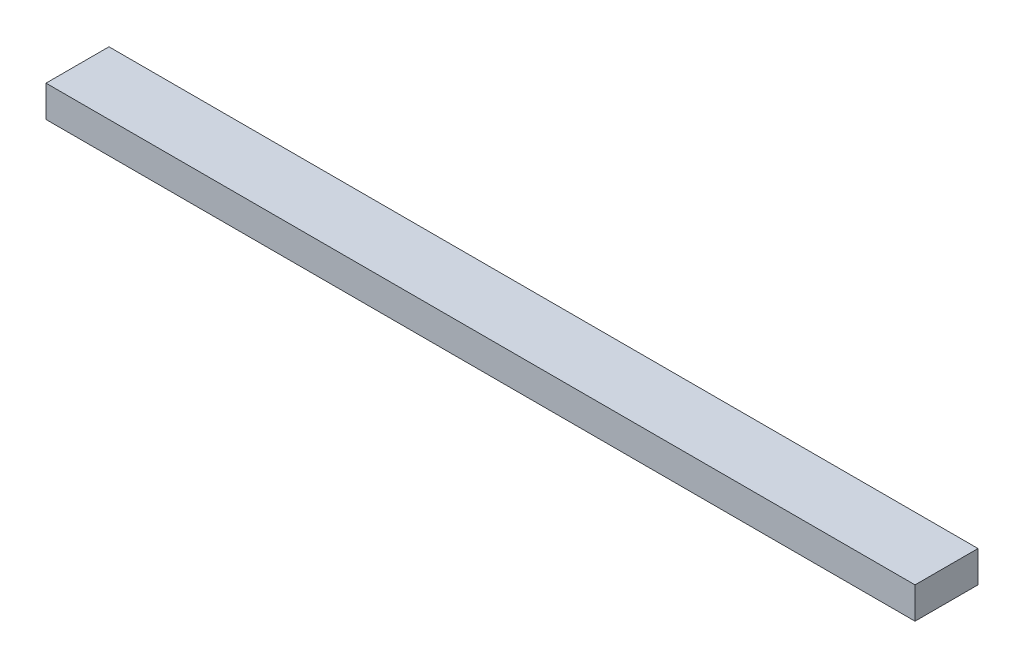
ISO-10303-21;
HEADER;
FILE_DESCRIPTION(('STEP AP214'),'2;1');
FILE_NAME('part.step','',(''),(''),'','','');
FILE_SCHEMA(('AUTOMOTIVE_DESIGN { 1 0 10303 214 1 1 1 1 }'));
ENDSEC;
DATA;
#1=APPLICATION_CONTEXT('core data for automotive mechanical design processes');
#2=APPLICATION_PROTOCOL_DEFINITION('international standard','automotive_design',2000,#1);
#3=PRODUCT_CONTEXT('',#1,'mechanical');
#4=PRODUCT('Part','Part','',(#3));
#5=PRODUCT_RELATED_PRODUCT_CATEGORY('part','',(#4));
#6=PRODUCT_DEFINITION_FORMATION('','',#4);
#7=PRODUCT_DEFINITION_CONTEXT('part definition',#1,'design');
#8=PRODUCT_DEFINITION('design','',#6,#7);
#9=PRODUCT_DEFINITION_SHAPE('','',#8);
#10=(LENGTH_UNIT() NAMED_UNIT(*) SI_UNIT(.MILLI.,.METRE.));
#11=(NAMED_UNIT(*) PLANE_ANGLE_UNIT() SI_UNIT($,.RADIAN.));
#12=(NAMED_UNIT(*) SI_UNIT($,.STERADIAN.) SOLID_ANGLE_UNIT());
#13=UNCERTAINTY_MEASURE_WITH_UNIT(LENGTH_MEASURE(1.E-05),#10,'distance_accuracy_value','');
#14=(GEOMETRIC_REPRESENTATION_CONTEXT(3) GLOBAL_UNCERTAINTY_ASSIGNED_CONTEXT((#13)) GLOBAL_UNIT_ASSIGNED_CONTEXT((#10,
#11,#12)) REPRESENTATION_CONTEXT('',''));
#15=CARTESIAN_POINT('',(0.,0.,0.));
#16=DIRECTION('',(0.,0.,1.));
#17=DIRECTION('',(1.,0.,0.));
#18=AXIS2_PLACEMENT_3D('',#15,#16,#17);
#19=CARTESIAN_POINT('',(87.63,6.35,6.35));
#20=DIRECTION('',(-1.,0.,0.));
#21=DIRECTION('',(0.,0.,1.));
#22=AXIS2_PLACEMENT_3D('',#19,#20,#21);
#23=PLANE('',#22);
#24=DIRECTION('',(0.,0.,-1.));
#25=VECTOR('',#24,1.);
#26=CARTESIAN_POINT('',(87.63,0.,6.35));
#27=LINE('',#26,#25);
#28=CARTESIAN_POINT('',(87.63,0.,6.35));
#29=VERTEX_POINT('',#28);
#30=CARTESIAN_POINT('',(87.63,0.,-6.35));
#31=VERTEX_POINT('',#30);
#32=EDGE_CURVE('E98',#29,#31,#27,.T.);
#33=ORIENTED_EDGE('',*,*,#32,.T.);
#34=DIRECTION('',(0.,-1.,0.));
#35=VECTOR('',#34,1.);
#36=CARTESIAN_POINT('',(87.63,6.35,-6.35));
#37=LINE('',#36,#35);
#38=CARTESIAN_POINT('',(87.63,6.35,-6.35));
#39=VERTEX_POINT('',#38);
#40=EDGE_CURVE('E11',#39,#31,#37,.T.);
#41=ORIENTED_EDGE('',*,*,#40,.F.);
#42=DIRECTION('',(0.,0.,-1.));
#43=VECTOR('',#42,1.);
#44=CARTESIAN_POINT('',(87.63,6.35,6.35));
#45=LINE('',#44,#43);
#46=CARTESIAN_POINT('',(87.63,6.35,6.35));
#47=VERTEX_POINT('',#46);
#48=EDGE_CURVE('E86',#47,#39,#45,.T.);
#49=ORIENTED_EDGE('',*,*,#48,.F.);
#50=DIRECTION('',(0.,-1.,0.));
#51=VECTOR('',#50,1.);
#52=CARTESIAN_POINT('',(87.63,6.35,6.35));
#53=LINE('',#52,#51);
#54=EDGE_CURVE('E94',#47,#29,#53,.T.);
#55=ORIENTED_EDGE('',*,*,#54,.T.);
#56=EDGE_LOOP('',(#33,#41,#49,#55));
#57=FACE_BOUND('',#56,.T.);
#58=ADVANCED_FACE('F35',(#57),#23,.F.);
#59=CARTESIAN_POINT('',(-87.63,6.35,-6.35));
#60=DIRECTION('',(0.,0.,1.));
#61=DIRECTION('',(1.,0.,0.));
#62=AXIS2_PLACEMENT_3D('',#59,#60,#61);
#63=PLANE('',#62);
#64=DIRECTION('',(-1.,0.,0.));
#65=VECTOR('',#64,1.);
#66=CARTESIAN_POINT('',(-87.63,0.,-6.35));
#67=LINE('',#66,#65);
#68=CARTESIAN_POINT('',(-87.63,0.,-6.35));
#69=VERTEX_POINT('',#68);
#70=EDGE_CURVE('E90',#31,#69,#67,.T.);
#71=ORIENTED_EDGE('',*,*,#70,.T.);
#72=DIRECTION('',(0.,-1.,0.));
#73=VECTOR('',#72,1.);
#74=CARTESIAN_POINT('',(-87.63,6.35,-6.35));
#75=LINE('',#74,#73);
#76=CARTESIAN_POINT('',(-87.63,6.35,-6.35));
#77=VERTEX_POINT('',#76);
#78=EDGE_CURVE('E43',#77,#69,#75,.T.);
#79=ORIENTED_EDGE('',*,*,#78,.F.);
#80=DIRECTION('',(-1.,0.,0.));
#81=VECTOR('',#80,1.);
#82=CARTESIAN_POINT('',(-87.63,6.35,-6.35));
#83=LINE('',#82,#81);
#84=EDGE_CURVE('E81',#39,#77,#83,.T.);
#85=ORIENTED_EDGE('',*,*,#84,.F.);
#86=ORIENTED_EDGE('',*,*,#40,.T.);
#87=EDGE_LOOP('',(#71,#79,#85,#86));
#88=FACE_BOUND('',#87,.T.);
#89=ADVANCED_FACE('F89',(#88),#63,.F.);
#90=CARTESIAN_POINT('',(-87.63,6.35,6.35));
#91=DIRECTION('',(1.,0.,0.));
#92=DIRECTION('',(0.,0.,-1.));
#93=AXIS2_PLACEMENT_3D('',#90,#91,#92);
#94=PLANE('',#93);
#95=DIRECTION('',(0.,0.,1.));
#96=VECTOR('',#95,1.);
#97=CARTESIAN_POINT('',(-87.63,0.,6.35));
#98=LINE('',#97,#96);
#99=CARTESIAN_POINT('',(-87.63,0.,6.35));
#100=VERTEX_POINT('',#99);
#101=EDGE_CURVE('E68',#69,#100,#98,.T.);
#102=ORIENTED_EDGE('',*,*,#101,.T.);
#103=DIRECTION('',(0.,-1.,0.));
#104=VECTOR('',#103,1.);
#105=CARTESIAN_POINT('',(-87.63,6.35,6.35));
#106=LINE('',#105,#104);
#107=CARTESIAN_POINT('',(-87.63,6.35,6.35));
#108=VERTEX_POINT('',#107);
#109=EDGE_CURVE('E91',#108,#100,#106,.T.);
#110=ORIENTED_EDGE('',*,*,#109,.F.);
#111=DIRECTION('',(0.,0.,1.));
#112=VECTOR('',#111,1.);
#113=CARTESIAN_POINT('',(-87.63,6.35,6.35));
#114=LINE('',#113,#112);
#115=EDGE_CURVE('E84',#77,#108,#114,.T.);
#116=ORIENTED_EDGE('',*,*,#115,.F.);
#117=ORIENTED_EDGE('',*,*,#78,.T.);
#118=EDGE_LOOP('',(#102,#110,#116,#117));
#119=FACE_BOUND('',#118,.T.);
#120=ADVANCED_FACE('F92',(#119),#94,.F.);
#121=CARTESIAN_POINT('',(-87.63,6.35,6.35));
#122=DIRECTION('',(0.,0.,-1.));
#123=DIRECTION('',(-1.,0.,0.));
#124=AXIS2_PLACEMENT_3D('',#121,#122,#123);
#125=PLANE('',#124);
#126=DIRECTION('',(1.,0.,0.));
#127=VECTOR('',#126,1.);
#128=CARTESIAN_POINT('',(-87.63,0.,6.35));
#129=LINE('',#128,#127);
#130=EDGE_CURVE('E74',#100,#29,#129,.T.);
#131=ORIENTED_EDGE('',*,*,#130,.T.);
#132=ORIENTED_EDGE('',*,*,#54,.F.);
#133=DIRECTION('',(1.,0.,0.));
#134=VECTOR('',#133,1.);
#135=CARTESIAN_POINT('',(-87.63,6.35,6.35));
#136=LINE('',#135,#134);
#137=EDGE_CURVE('E51',#108,#47,#136,.T.);
#138=ORIENTED_EDGE('',*,*,#137,.F.);
#139=ORIENTED_EDGE('',*,*,#109,.T.);
#140=EDGE_LOOP('',(#131,#132,#138,#139));
#141=FACE_BOUND('',#140,.T.);
#142=ADVANCED_FACE('F105',(#141),#125,.F.);
#143=CARTESIAN_POINT('',(0.,6.35,0.));
#144=DIRECTION('',(0.,-1.,0.));
#145=DIRECTION('',(0.,0.,-1.));
#146=AXIS2_PLACEMENT_3D('',#143,#144,#145);
#147=PLANE('',#146);
#148=ORIENTED_EDGE('',*,*,#48,.T.);
#149=ORIENTED_EDGE('',*,*,#84,.T.);
#150=ORIENTED_EDGE('',*,*,#115,.T.);
#151=ORIENTED_EDGE('',*,*,#137,.T.);
#152=EDGE_LOOP('',(#148,#149,#150,#151));
#153=FACE_BOUND('',#152,.T.);
#154=ADVANCED_FACE('F82',(#153),#147,.F.);
#155=CARTESIAN_POINT('',(0.,0.,0.));
#156=DIRECTION('',(0.,-1.,0.));
#157=DIRECTION('',(0.,0.,-1.));
#158=AXIS2_PLACEMENT_3D('',#155,#156,#157);
#159=PLANE('',#158);
#160=ORIENTED_EDGE('',*,*,#32,.F.);
#161=ORIENTED_EDGE('',*,*,#130,.F.);
#162=ORIENTED_EDGE('',*,*,#101,.F.);
#163=ORIENTED_EDGE('',*,*,#70,.F.);
#164=EDGE_LOOP('',(#160,#161,#162,#163));
#165=FACE_BOUND('',#164,.T.);
#166=ADVANCED_FACE('F108',(#165),#159,.T.);
#167=CLOSED_SHELL('',(#58,#89,#120,#142,#154,#166));
#168=MANIFOLD_SOLID_BREP('B2',#167);
#169=ADVANCED_BREP_SHAPE_REPRESENTATION('',(#18,#168),#14);
#170=SHAPE_DEFINITION_REPRESENTATION(#9,#169);
ENDSEC;
END-ISO-10303-21;
